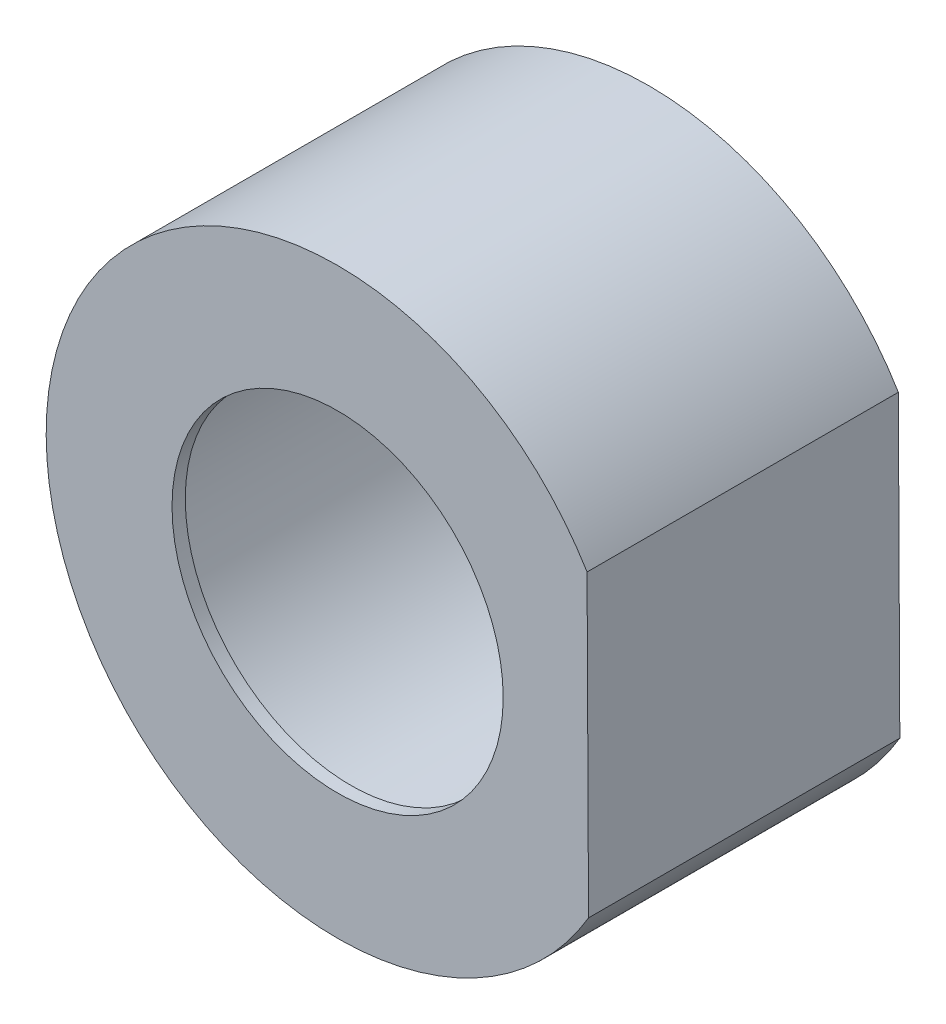
ISO-10303-21;
HEADER;
FILE_DESCRIPTION(('STEP AP214'),'2;1');
FILE_NAME('part.step','',(''),(''),'','','');
FILE_SCHEMA(('AUTOMOTIVE_DESIGN { 1 0 10303 214 1 1 1 1 }'));
ENDSEC;
DATA;
#1=APPLICATION_CONTEXT('core data for automotive mechanical design processes');
#2=APPLICATION_PROTOCOL_DEFINITION('international standard','automotive_design',2000,#1);
#3=PRODUCT_CONTEXT('',#1,'mechanical');
#4=PRODUCT('Part','Part','',(#3));
#5=PRODUCT_RELATED_PRODUCT_CATEGORY('part','',(#4));
#6=PRODUCT_DEFINITION_FORMATION('','',#4);
#7=PRODUCT_DEFINITION_CONTEXT('part definition',#1,'design');
#8=PRODUCT_DEFINITION('design','',#6,#7);
#9=PRODUCT_DEFINITION_SHAPE('','',#8);
#10=(LENGTH_UNIT() NAMED_UNIT(*) SI_UNIT(.MILLI.,.METRE.));
#11=(NAMED_UNIT(*) PLANE_ANGLE_UNIT() SI_UNIT($,.RADIAN.));
#12=(NAMED_UNIT(*) SI_UNIT($,.STERADIAN.) SOLID_ANGLE_UNIT());
#13=UNCERTAINTY_MEASURE_WITH_UNIT(LENGTH_MEASURE(1.E-05),#10,'distance_accuracy_value','');
#14=(GEOMETRIC_REPRESENTATION_CONTEXT(3) GLOBAL_UNCERTAINTY_ASSIGNED_CONTEXT((#13)) GLOBAL_UNIT_ASSIGNED_CONTEXT((#10,
#11,#12)) REPRESENTATION_CONTEXT('',''));
#15=CARTESIAN_POINT('',(0.,0.,0.));
#16=DIRECTION('',(0.,0.,1.));
#17=DIRECTION('',(1.,0.,0.));
#18=AXIS2_PLACEMENT_3D('',#15,#16,#17);
#19=CARTESIAN_POINT('',(19.1172584292297,-46.7893175505529,23.5));
#20=DIRECTION('',(-0.999988028182187,-0.00489320879401898,0.));
#21=DIRECTION('',(0.00489320879401898,-0.999988028182187,0.));
#22=AXIS2_PLACEMENT_3D('',#19,#20,#21);
#23=PLANE('',#22);
#24=DIRECTION('',(-0.00489320879401898,0.999988028182187,0.));
#25=VECTOR('',#24,1.);
#26=CARTESIAN_POINT('',(19.1172584292297,-46.7893175505529,0.));
#27=LINE('',#26,#25);
#28=CARTESIAN_POINT('',(18.9430493752666,-11.1875323626889,0.));
#29=VERTEX_POINT('',#28);
#30=CARTESIAN_POINT('',(18.8326576970166,11.3723789976856,0.));
#31=VERTEX_POINT('',#30);
#32=EDGE_CURVE('E65',#29,#31,#27,.T.);
#33=ORIENTED_EDGE('',*,*,#32,.T.);
#34=DIRECTION('',(0.,0.,-1.));
#35=VECTOR('',#34,1.);
#36=CARTESIAN_POINT('',(18.8326576970166,11.3723789976856,23.5));
#37=LINE('',#36,#35);
#38=CARTESIAN_POINT('',(18.8326576970166,11.3723789976856,23.5));
#39=VERTEX_POINT('',#38);
#40=EDGE_CURVE('E11',#39,#31,#37,.T.);
#41=ORIENTED_EDGE('',*,*,#40,.F.);
#42=DIRECTION('',(-0.00489320879401898,0.999988028182187,0.));
#43=VECTOR('',#42,1.);
#44=CARTESIAN_POINT('',(19.1172584292297,-46.7893175505529,23.5));
#45=LINE('',#44,#43);
#46=CARTESIAN_POINT('',(18.9430493752666,-11.1875323626889,23.5));
#47=VERTEX_POINT('',#46);
#48=EDGE_CURVE('E64',#47,#39,#45,.T.);
#49=ORIENTED_EDGE('',*,*,#48,.F.);
#50=DIRECTION('',(0.,0.,-1.));
#51=VECTOR('',#50,1.);
#52=CARTESIAN_POINT('',(18.9430493752666,-11.1875323626889,23.5));
#53=LINE('',#52,#51);
#54=EDGE_CURVE('E42',#47,#29,#53,.T.);
#55=ORIENTED_EDGE('',*,*,#54,.T.);
#56=EDGE_LOOP('',(#33,#41,#49,#55));
#57=FACE_BOUND('',#56,.T.);
#58=ADVANCED_FACE('F34',(#57),#23,.F.);
#59=CARTESIAN_POINT('',(0.,0.,23.5));
#60=DIRECTION('',(0.,0.,-1.));
#61=DIRECTION('',(-1.,0.,0.));
#62=AXIS2_PLACEMENT_3D('',#59,#60,#61);
#63=CYLINDRICAL_SURFACE('',#62,22.);
#64=CARTESIAN_POINT('',(0.,0.,0.));
#65=DIRECTION('',(0.,0.,1.));
#66=DIRECTION('',(1.,0.,0.));
#67=AXIS2_PLACEMENT_3D('',#64,#65,#66);
#68=CIRCLE('',#67,22.);
#69=EDGE_CURVE('E57',#31,#29,#68,.T.);
#70=ORIENTED_EDGE('',*,*,#69,.T.);
#71=ORIENTED_EDGE('',*,*,#54,.F.);
#72=CARTESIAN_POINT('',(0.,0.,23.5));
#73=DIRECTION('',(0.,0.,1.));
#74=DIRECTION('',(1.,0.,0.));
#75=AXIS2_PLACEMENT_3D('',#72,#73,#74);
#76=CIRCLE('',#75,22.);
#77=EDGE_CURVE('E49',#39,#47,#76,.T.);
#78=ORIENTED_EDGE('',*,*,#77,.F.);
#79=ORIENTED_EDGE('',*,*,#40,.T.);
#80=EDGE_LOOP('',(#70,#71,#78,#79));
#81=FACE_BOUND('',#80,.T.);
#82=ADVANCED_FACE('F60',(#81),#63,.T.);
#83=CARTESIAN_POINT('',(-1.52847531236671,-46.8903426459103,23.5));
#84=DIRECTION('',(0.,0.,1.));
#85=DIRECTION('',(1.,0.,0.));
#86=AXIS2_PLACEMENT_3D('',#83,#84,#85);
#87=PLANE('',#86);
#88=CARTESIAN_POINT('',(0.,0.,23.5));
#89=DIRECTION('',(0.,0.,-1.));
#90=DIRECTION('',(-1.,0.,0.));
#91=AXIS2_PLACEMENT_3D('',#88,#89,#90);
#92=CIRCLE('',#91,12.5);
#93=CARTESIAN_POINT('',(-12.5,0.,23.5));
#94=VERTEX_POINT('',#93);
#95=EDGE_CURVE('E78',#94,#94,#92,.T.);
#96=ORIENTED_EDGE('',*,*,#95,.T.);
#97=EDGE_LOOP('',(#96));
#98=FACE_BOUND('',#97,.T.);
#99=ORIENTED_EDGE('',*,*,#48,.T.);
#100=ORIENTED_EDGE('',*,*,#77,.T.);
#101=EDGE_LOOP('',(#99,#100));
#102=FACE_BOUND('',#101,.T.);
#103=ADVANCED_FACE('F86',(#98,#102),#87,.T.);
#104=CARTESIAN_POINT('',(-1.52847531236671,-46.8903426459103,0.));
#105=DIRECTION('',(0.,0.,1.));
#106=DIRECTION('',(1.,0.,0.));
#107=AXIS2_PLACEMENT_3D('',#104,#105,#106);
#108=PLANE('',#107);
#109=CARTESIAN_POINT('',(0.,0.,0.));
#110=DIRECTION('',(0.,0.,-1.));
#111=DIRECTION('',(-1.,0.,0.));
#112=AXIS2_PLACEMENT_3D('',#109,#110,#111);
#113=CIRCLE('',#112,16.);
#114=CARTESIAN_POINT('',(-16.,0.,0.));
#115=VERTEX_POINT('',#114);
#116=EDGE_CURVE('E72',#115,#115,#113,.T.);
#117=ORIENTED_EDGE('',*,*,#116,.F.);
#118=EDGE_LOOP('',(#117));
#119=FACE_BOUND('',#118,.T.);
#120=ORIENTED_EDGE('',*,*,#32,.F.);
#121=ORIENTED_EDGE('',*,*,#69,.F.);
#122=EDGE_LOOP('',(#120,#121));
#123=FACE_BOUND('',#122,.T.);
#124=ADVANCED_FACE('F68',(#119,#123),#108,.F.);
#125=CARTESIAN_POINT('',(0.,0.,22.5));
#126=DIRECTION('',(0.,0.,-1.));
#127=DIRECTION('',(-1.,0.,0.));
#128=AXIS2_PLACEMENT_3D('',#125,#126,#127);
#129=CYLINDRICAL_SURFACE('',#128,16.);
#130=CARTESIAN_POINT('',(0.,0.,22.5));
#131=DIRECTION('',(0.,0.,-1.));
#132=DIRECTION('',(-1.,0.,0.));
#133=AXIS2_PLACEMENT_3D('',#130,#131,#132);
#134=CIRCLE('',#133,16.);
#135=CARTESIAN_POINT('',(-16.,0.,22.5));
#136=VERTEX_POINT('',#135);
#137=EDGE_CURVE('E69',#136,#136,#134,.T.);
#138=ORIENTED_EDGE('',*,*,#137,.F.);
#139=EDGE_LOOP('',(#138));
#140=FACE_BOUND('',#139,.T.);
#141=ORIENTED_EDGE('',*,*,#116,.T.);
#142=EDGE_LOOP('',(#141));
#143=FACE_BOUND('',#142,.T.);
#144=ADVANCED_FACE('F97',(#140,#143),#129,.F.);
#145=CARTESIAN_POINT('',(0.,0.,22.5));
#146=DIRECTION('',(0.,0.,-1.));
#147=DIRECTION('',(-1.,0.,0.));
#148=AXIS2_PLACEMENT_3D('',#145,#146,#147);
#149=PLANE('',#148);
#150=CARTESIAN_POINT('',(0.,0.,22.5));
#151=DIRECTION('',(0.,0.,-1.));
#152=DIRECTION('',(-1.,0.,0.));
#153=AXIS2_PLACEMENT_3D('',#150,#151,#152);
#154=CIRCLE('',#153,12.5);
#155=CARTESIAN_POINT('',(-12.5,0.,22.5));
#156=VERTEX_POINT('',#155);
#157=EDGE_CURVE('E80',#156,#156,#154,.T.);
#158=ORIENTED_EDGE('',*,*,#157,.F.);
#159=EDGE_LOOP('',(#158));
#160=FACE_BOUND('',#159,.T.);
#161=ORIENTED_EDGE('',*,*,#137,.T.);
#162=EDGE_LOOP('',(#161));
#163=FACE_BOUND('',#162,.T.);
#164=ADVANCED_FACE('F91',(#160,#163),#149,.T.);
#165=CARTESIAN_POINT('',(0.,0.,23.5));
#166=DIRECTION('',(0.,0.,-1.));
#167=DIRECTION('',(-1.,0.,0.));
#168=AXIS2_PLACEMENT_3D('',#165,#166,#167);
#169=CYLINDRICAL_SURFACE('',#168,12.5);
#170=ORIENTED_EDGE('',*,*,#95,.F.);
#171=EDGE_LOOP('',(#170));
#172=FACE_BOUND('',#171,.T.);
#173=ORIENTED_EDGE('',*,*,#157,.T.);
#174=EDGE_LOOP('',(#173));
#175=FACE_BOUND('',#174,.T.);
#176=ADVANCED_FACE('F88',(#172,#175),#169,.F.);
#177=CLOSED_SHELL('',(#58,#82,#103,#124,#144,#164,#176));
#178=MANIFOLD_SOLID_BREP('B2',#177);
#179=ADVANCED_BREP_SHAPE_REPRESENTATION('',(#18,#178),#14);
#180=SHAPE_DEFINITION_REPRESENTATION(#9,#179);
ENDSEC;
END-ISO-10303-21;
